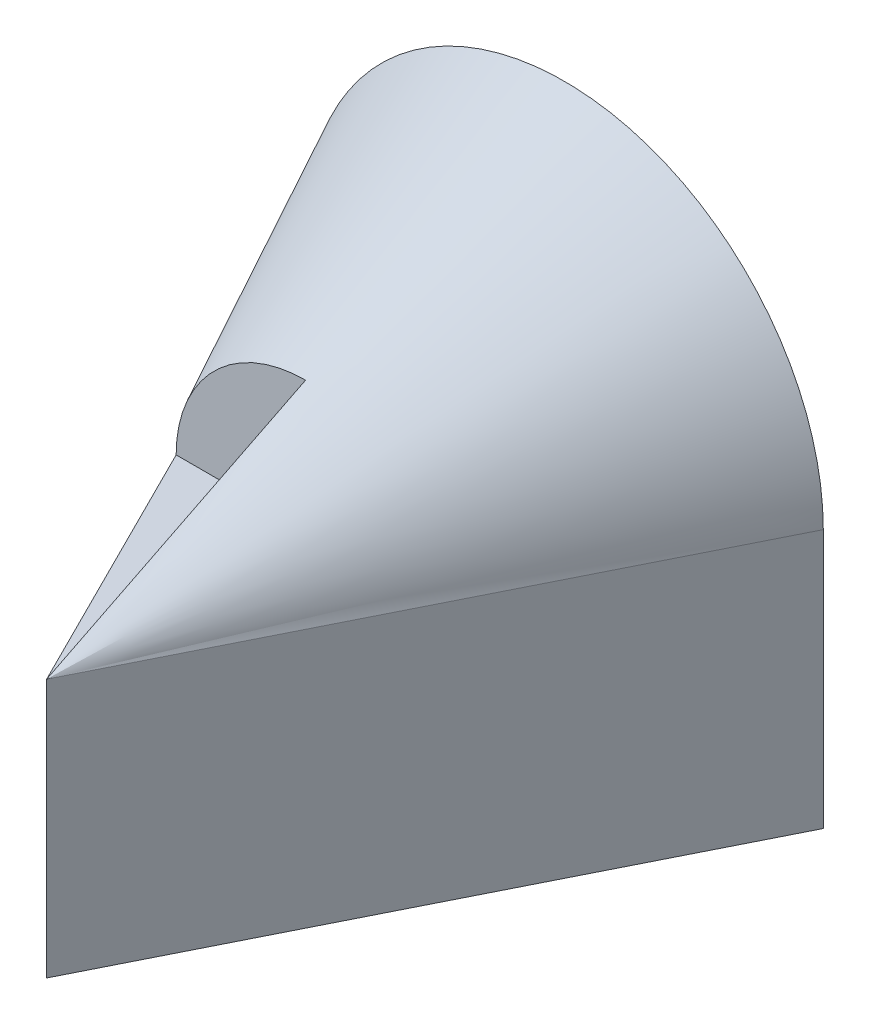
ISO-10303-21;
HEADER;
FILE_DESCRIPTION(('STEP AP214'),'2;1');
FILE_NAME('part.step','',(''),(''),'','','');
FILE_SCHEMA(('AUTOMOTIVE_DESIGN { 1 0 10303 214 1 1 1 1 }'));
ENDSEC;
DATA;
#1=APPLICATION_CONTEXT('core data for automotive mechanical design processes');
#2=APPLICATION_PROTOCOL_DEFINITION('international standard','automotive_design',2000,#1);
#3=PRODUCT_CONTEXT('',#1,'mechanical');
#4=PRODUCT('Part','Part','',(#3));
#5=PRODUCT_RELATED_PRODUCT_CATEGORY('part','',(#4));
#6=PRODUCT_DEFINITION_FORMATION('','',#4);
#7=PRODUCT_DEFINITION_CONTEXT('part definition',#1,'design');
#8=PRODUCT_DEFINITION('design','',#6,#7);
#9=PRODUCT_DEFINITION_SHAPE('','',#8);
#10=(LENGTH_UNIT() NAMED_UNIT(*) SI_UNIT(.MILLI.,.METRE.));
#11=(NAMED_UNIT(*) PLANE_ANGLE_UNIT() SI_UNIT($,.RADIAN.));
#12=(NAMED_UNIT(*) SI_UNIT($,.STERADIAN.) SOLID_ANGLE_UNIT());
#13=UNCERTAINTY_MEASURE_WITH_UNIT(LENGTH_MEASURE(1.E-05),#10,'distance_accuracy_value','');
#14=(GEOMETRIC_REPRESENTATION_CONTEXT(3) GLOBAL_UNCERTAINTY_ASSIGNED_CONTEXT((#13)) GLOBAL_UNIT_ASSIGNED_CONTEXT((#10,
#11,#12)) REPRESENTATION_CONTEXT('',''));
#15=CARTESIAN_POINT('',(0.,0.,0.));
#16=DIRECTION('',(0.,0.,1.));
#17=DIRECTION('',(1.,0.,0.));
#18=AXIS2_PLACEMENT_3D('',#15,#16,#17);
#19=CARTESIAN_POINT('',(20.,20.,0.));
#20=DIRECTION('',(0.,0.,-1.));
#21=DIRECTION('',(-1.,0.,0.));
#22=AXIS2_PLACEMENT_3D('',#19,#20,#21);
#23=CONICAL_SURFACE('',#22,20.,0.463647609000806);
#24=DIRECTION('',(0.,0.447213595499958,-0.894427190999916));
#25=VECTOR('',#24,1.);
#26=CARTESIAN_POINT('',(20.,20.,40.));
#27=LINE('',#26,#25);
#28=CARTESIAN_POINT('',(20.,20.,40.));
#29=VERTEX_POINT('',#28);
#30=CARTESIAN_POINT('',(20.,30.,20.));
#31=VERTEX_POINT('',#30);
#32=EDGE_CURVE('E12',#29,#31,#27,.T.);
#33=ORIENTED_EDGE('',*,*,#32,.F.);
#34=DIRECTION('',(-0.447213595499958,0.,0.894427190999916));
#35=VECTOR('',#34,1.);
#36=CARTESIAN_POINT('',(32.,20.,16.));
#37=LINE('',#36,#35);
#38=CARTESIAN_POINT('',(40.,20.,0.));
#39=VERTEX_POINT('',#38);
#40=EDGE_CURVE('E114',#39,#29,#37,.T.);
#41=ORIENTED_EDGE('',*,*,#40,.F.);
#42=CARTESIAN_POINT('',(20.,20.,0.));
#43=DIRECTION('',(0.,0.,1.));
#44=DIRECTION('',(1.,0.,0.));
#45=AXIS2_PLACEMENT_3D('',#42,#43,#44);
#46=CIRCLE('',#45,20.);
#47=CARTESIAN_POINT('',(0.,20.,0.));
#48=VERTEX_POINT('',#47);
#49=EDGE_CURVE('E124',#39,#48,#46,.T.);
#50=ORIENTED_EDGE('',*,*,#49,.T.);
#51=DIRECTION('',(0.447213595499958,0.,0.894427190999916));
#52=VECTOR('',#51,1.);
#53=CARTESIAN_POINT('',(12.,20.,24.));
#54=LINE('',#53,#52);
#55=CARTESIAN_POINT('',(10.,20.,20.));
#56=VERTEX_POINT('',#55);
#57=EDGE_CURVE('E128',#48,#56,#54,.T.);
#58=ORIENTED_EDGE('',*,*,#57,.T.);
#59=CARTESIAN_POINT('',(20.,20.,20.));
#60=DIRECTION('',(0.,0.,1.));
#61=DIRECTION('',(1.,0.,0.));
#62=AXIS2_PLACEMENT_3D('',#59,#60,#61);
#63=CIRCLE('',#62,10.);
#64=EDGE_CURVE('E62',#31,#56,#63,.T.);
#65=ORIENTED_EDGE('',*,*,#64,.F.);
#66=EDGE_LOOP('',(#33,#41,#50,#58,#65));
#67=FACE_BOUND('',#66,.T.);
#68=ADVANCED_FACE('F54',(#67),#23,.T.);
#69=CARTESIAN_POINT('',(0.,59.,0.));
#70=DIRECTION('',(0.894427190999916,0.,-0.447213595499958));
#71=DIRECTION('',(-0.447213595499958,0.,-0.894427190999916));
#72=AXIS2_PLACEMENT_3D('',#69,#70,#71);
#73=PLANE('',#72);
#74=ORIENTED_EDGE('',*,*,#57,.F.);
#75=DIRECTION('',(0.,1.,0.));
#76=VECTOR('',#75,1.);
#77=CARTESIAN_POINT('',(0.,0.,0.));
#78=LINE('',#77,#76);
#79=CARTESIAN_POINT('',(0.,0.,0.));
#80=VERTEX_POINT('',#79);
#81=EDGE_CURVE('E77',#80,#48,#78,.T.);
#82=ORIENTED_EDGE('',*,*,#81,.F.);
#83=DIRECTION('',(0.447213595499958,0.,0.894427190999916));
#84=VECTOR('',#83,1.);
#85=CARTESIAN_POINT('',(0.,0.,0.));
#86=LINE('',#85,#84);
#87=CARTESIAN_POINT('',(20.,0.,40.));
#88=VERTEX_POINT('',#87);
#89=EDGE_CURVE('E127',#80,#88,#86,.T.);
#90=ORIENTED_EDGE('',*,*,#89,.T.);
#91=DIRECTION('',(0.,-1.,0.));
#92=VECTOR('',#91,1.);
#93=CARTESIAN_POINT('',(20.,59.,40.));
#94=LINE('',#93,#92);
#95=EDGE_CURVE('E119',#29,#88,#94,.T.);
#96=ORIENTED_EDGE('',*,*,#95,.F.);
#97=DIRECTION('',(0.447213595499958,0.,0.894427190999916));
#98=VECTOR('',#97,1.);
#99=CARTESIAN_POINT('',(10.,20.,20.));
#100=LINE('',#99,#98);
#101=EDGE_CURVE('E104',#56,#29,#100,.T.);
#102=ORIENTED_EDGE('',*,*,#101,.F.);
#103=EDGE_LOOP('',(#74,#82,#90,#96,#102));
#104=FACE_BOUND('',#103,.T.);
#105=ADVANCED_FACE('F126',(#104),#73,.F.);
#106=CARTESIAN_POINT('',(32.,59.,16.));
#107=DIRECTION('',(-0.894427190999916,0.,-0.447213595499958));
#108=DIRECTION('',(-0.447213595499958,0.,0.894427190999916));
#109=AXIS2_PLACEMENT_3D('',#106,#107,#108);
#110=PLANE('',#109);
#111=DIRECTION('',(0.,1.,0.));
#112=VECTOR('',#111,1.);
#113=CARTESIAN_POINT('',(40.,0.,0.));
#114=LINE('',#113,#112);
#115=CARTESIAN_POINT('',(40.,0.,0.));
#116=VERTEX_POINT('',#115);
#117=EDGE_CURVE('E122',#116,#39,#114,.T.);
#118=ORIENTED_EDGE('',*,*,#117,.T.);
#119=ORIENTED_EDGE('',*,*,#40,.T.);
#120=ORIENTED_EDGE('',*,*,#95,.T.);
#121=DIRECTION('',(0.447213595499958,0.,-0.894427190999916));
#122=VECTOR('',#121,1.);
#123=CARTESIAN_POINT('',(32.,0.,16.));
#124=LINE('',#123,#122);
#125=EDGE_CURVE('E123',#88,#116,#124,.T.);
#126=ORIENTED_EDGE('',*,*,#125,.T.);
#127=EDGE_LOOP('',(#118,#119,#120,#126));
#128=FACE_BOUND('',#127,.T.);
#129=ADVANCED_FACE('F118',(#128),#110,.F.);
#130=CARTESIAN_POINT('',(0.,0.,40.));
#131=DIRECTION('',(0.,1.,0.));
#132=DIRECTION('',(0.,0.,1.));
#133=AXIS2_PLACEMENT_3D('',#130,#131,#132);
#134=PLANE('',#133);
#135=DIRECTION('',(1.,0.,0.));
#136=VECTOR('',#135,1.);
#137=CARTESIAN_POINT('',(0.,0.,0.));
#138=LINE('',#137,#136);
#139=EDGE_CURVE('E135',#80,#116,#138,.T.);
#140=ORIENTED_EDGE('',*,*,#139,.T.);
#141=ORIENTED_EDGE('',*,*,#125,.F.);
#142=ORIENTED_EDGE('',*,*,#89,.F.);
#143=EDGE_LOOP('',(#140,#141,#142));
#144=FACE_BOUND('',#143,.T.);
#145=ADVANCED_FACE('F56',(#144),#134,.F.);
#146=CARTESIAN_POINT('',(0.,0.,0.));
#147=DIRECTION('',(0.,0.,1.));
#148=DIRECTION('',(1.,0.,0.));
#149=AXIS2_PLACEMENT_3D('',#146,#147,#148);
#150=PLANE('',#149);
#151=ORIENTED_EDGE('',*,*,#81,.T.);
#152=ORIENTED_EDGE('',*,*,#49,.F.);
#153=ORIENTED_EDGE('',*,*,#117,.F.);
#154=ORIENTED_EDGE('',*,*,#139,.F.);
#155=EDGE_LOOP('',(#151,#152,#153,#154));
#156=FACE_BOUND('',#155,.T.);
#157=ADVANCED_FACE('F146',(#156),#150,.F.);
#158=CARTESIAN_POINT('',(20.,40.,40.));
#159=DIRECTION('',(-1.,0.,0.));
#160=DIRECTION('',(0.,0.,1.));
#161=AXIS2_PLACEMENT_3D('',#158,#159,#160);
#162=PLANE('',#161);
#163=ORIENTED_EDGE('',*,*,#32,.T.);
#164=DIRECTION('',(0.,-1.,0.));
#165=VECTOR('',#164,1.);
#166=CARTESIAN_POINT('',(20.,40.,20.));
#167=LINE('',#166,#165);
#168=CARTESIAN_POINT('',(20.,20.,20.));
#169=VERTEX_POINT('',#168);
#170=EDGE_CURVE('E103',#31,#169,#167,.T.);
#171=ORIENTED_EDGE('',*,*,#170,.T.);
#172=DIRECTION('',(0.,0.,-1.));
#173=VECTOR('',#172,1.);
#174=CARTESIAN_POINT('',(20.,20.,40.));
#175=LINE('',#174,#173);
#176=EDGE_CURVE('E99',#29,#169,#175,.T.);
#177=ORIENTED_EDGE('',*,*,#176,.F.);
#178=EDGE_LOOP('',(#163,#171,#177));
#179=FACE_BOUND('',#178,.T.);
#180=ADVANCED_FACE('F100',(#179),#162,.T.);
#181=CARTESIAN_POINT('',(20.,40.,20.));
#182=DIRECTION('',(0.,0.,1.));
#183=DIRECTION('',(1.,0.,0.));
#184=AXIS2_PLACEMENT_3D('',#181,#182,#183);
#185=PLANE('',#184);
#186=ORIENTED_EDGE('',*,*,#64,.T.);
#187=DIRECTION('',(-1.,0.,0.));
#188=VECTOR('',#187,1.);
#189=CARTESIAN_POINT('',(20.,20.,20.));
#190=LINE('',#189,#188);
#191=EDGE_CURVE('E69',#169,#56,#190,.T.);
#192=ORIENTED_EDGE('',*,*,#191,.F.);
#193=ORIENTED_EDGE('',*,*,#170,.F.);
#194=EDGE_LOOP('',(#186,#192,#193));
#195=FACE_BOUND('',#194,.T.);
#196=ADVANCED_FACE('F139',(#195),#185,.T.);
#197=CARTESIAN_POINT('',(0.,20.,0.));
#198=DIRECTION('',(0.,-1.,0.));
#199=DIRECTION('',(0.,0.,-1.));
#200=AXIS2_PLACEMENT_3D('',#197,#198,#199);
#201=PLANE('',#200);
#202=ORIENTED_EDGE('',*,*,#101,.T.);
#203=ORIENTED_EDGE('',*,*,#176,.T.);
#204=ORIENTED_EDGE('',*,*,#191,.T.);
#205=EDGE_LOOP('',(#202,#203,#204));
#206=FACE_BOUND('',#205,.T.);
#207=ADVANCED_FACE('F107',(#206),#201,.F.);
#208=CLOSED_SHELL('',(#68,#105,#129,#145,#157,#180,#196,#207));
#209=MANIFOLD_SOLID_BREP('B2',#208);
#210=ADVANCED_BREP_SHAPE_REPRESENTATION('',(#18,#209),#14);
#211=SHAPE_DEFINITION_REPRESENTATION(#9,#210);
ENDSEC;
END-ISO-10303-21;
